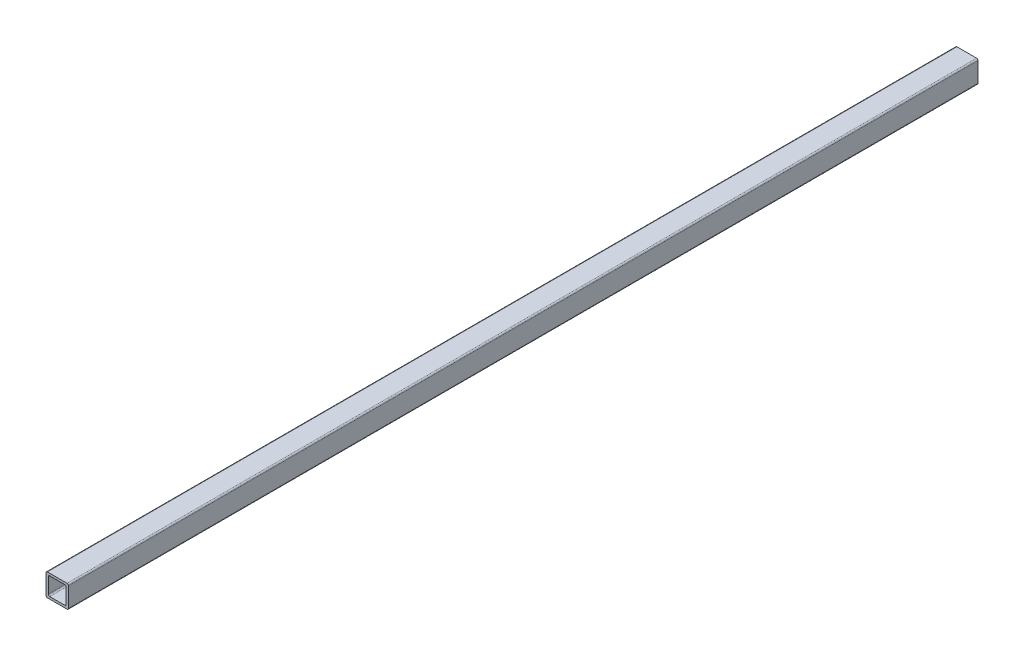
ISO-10303-21;
HEADER;
FILE_DESCRIPTION(('STEP AP214'),'2;1');
FILE_NAME('part.step','',(''),(''),'','','');
FILE_SCHEMA(('AUTOMOTIVE_DESIGN { 1 0 10303 214 1 1 1 1 }'));
ENDSEC;
DATA;
#1=APPLICATION_CONTEXT('core data for automotive mechanical design processes');
#2=APPLICATION_PROTOCOL_DEFINITION('international standard','automotive_design',2000,#1);
#3=PRODUCT_CONTEXT('',#1,'mechanical');
#4=PRODUCT('Part','Part','',(#3));
#5=PRODUCT_RELATED_PRODUCT_CATEGORY('part','',(#4));
#6=PRODUCT_DEFINITION_FORMATION('','',#4);
#7=PRODUCT_DEFINITION_CONTEXT('part definition',#1,'design');
#8=PRODUCT_DEFINITION('design','',#6,#7);
#9=PRODUCT_DEFINITION_SHAPE('','',#8);
#10=(LENGTH_UNIT() NAMED_UNIT(*) SI_UNIT(.MILLI.,.METRE.));
#11=(NAMED_UNIT(*) PLANE_ANGLE_UNIT() SI_UNIT($,.RADIAN.));
#12=(NAMED_UNIT(*) SI_UNIT($,.STERADIAN.) SOLID_ANGLE_UNIT());
#13=UNCERTAINTY_MEASURE_WITH_UNIT(LENGTH_MEASURE(1.E-05),#10,'distance_accuracy_value','');
#14=(GEOMETRIC_REPRESENTATION_CONTEXT(3) GLOBAL_UNCERTAINTY_ASSIGNED_CONTEXT((#13)) GLOBAL_UNIT_ASSIGNED_CONTEXT((#10,
#11,#12)) REPRESENTATION_CONTEXT('',''));
#15=CARTESIAN_POINT('',(0.,0.,0.));
#16=DIRECTION('',(0.,0.,1.));
#17=DIRECTION('',(1.,0.,0.));
#18=AXIS2_PLACEMENT_3D('',#15,#16,#17);
#19=CARTESIAN_POINT('',(0.,0.,320.));
#20=DIRECTION('',(0.,0.,1.));
#21=DIRECTION('',(1.,0.,0.));
#22=AXIS2_PLACEMENT_3D('',#19,#20,#21);
#23=PLANE('',#22);
#24=DIRECTION('',(0.,1.,0.));
#25=VECTOR('',#24,1.);
#26=CARTESIAN_POINT('',(3.95,-3.95,320.));
#27=LINE('',#26,#25);
#28=CARTESIAN_POINT('',(3.95,-3.45,320.));
#29=VERTEX_POINT('',#28);
#30=CARTESIAN_POINT('',(3.95,3.45,320.));
#31=VERTEX_POINT('',#30);
#32=EDGE_CURVE('E329',#29,#31,#27,.T.);
#33=ORIENTED_EDGE('',*,*,#32,.T.);
#34=CARTESIAN_POINT('',(3.45,3.45,320.));
#35=DIRECTION('',(0.,0.,1.));
#36=DIRECTION('',(1.,0.,0.));
#37=AXIS2_PLACEMENT_3D('',#34,#35,#36);
#38=CIRCLE('',#37,0.5);
#39=CARTESIAN_POINT('',(3.45,3.95,320.));
#40=VERTEX_POINT('',#39);
#41=EDGE_CURVE('E219',#31,#40,#38,.T.);
#42=ORIENTED_EDGE('',*,*,#41,.T.);
#43=DIRECTION('',(-1.,0.,0.));
#44=VECTOR('',#43,1.);
#45=CARTESIAN_POINT('',(3.95,3.95,320.));
#46=LINE('',#45,#44);
#47=CARTESIAN_POINT('',(-3.45,3.95,320.));
#48=VERTEX_POINT('',#47);
#49=EDGE_CURVE('E175',#40,#48,#46,.T.);
#50=ORIENTED_EDGE('',*,*,#49,.T.);
#51=CARTESIAN_POINT('',(-3.45,3.45,320.));
#52=DIRECTION('',(0.,0.,1.));
#53=DIRECTION('',(1.,0.,0.));
#54=AXIS2_PLACEMENT_3D('',#51,#52,#53);
#55=CIRCLE('',#54,0.5);
#56=CARTESIAN_POINT('',(-3.95,3.45,320.));
#57=VERTEX_POINT('',#56);
#58=EDGE_CURVE('E210',#48,#57,#55,.T.);
#59=ORIENTED_EDGE('',*,*,#58,.T.);
#60=DIRECTION('',(0.,-1.,0.));
#61=VECTOR('',#60,1.);
#62=CARTESIAN_POINT('',(-3.95,-3.95,320.));
#63=LINE('',#62,#61);
#64=CARTESIAN_POINT('',(-3.95,-3.45,320.));
#65=VERTEX_POINT('',#64);
#66=EDGE_CURVE('E184',#57,#65,#63,.T.);
#67=ORIENTED_EDGE('',*,*,#66,.T.);
#68=CARTESIAN_POINT('',(-3.45,-3.45,320.));
#69=DIRECTION('',(0.,0.,1.));
#70=DIRECTION('',(1.,0.,0.));
#71=AXIS2_PLACEMENT_3D('',#68,#69,#70);
#72=CIRCLE('',#71,0.5);
#73=CARTESIAN_POINT('',(-3.45,-3.95,320.));
#74=VERTEX_POINT('',#73);
#75=EDGE_CURVE('E213',#65,#74,#72,.T.);
#76=ORIENTED_EDGE('',*,*,#75,.T.);
#77=DIRECTION('',(1.,0.,0.));
#78=VECTOR('',#77,1.);
#79=CARTESIAN_POINT('',(3.95,-3.95,320.));
#80=LINE('',#79,#78);
#81=CARTESIAN_POINT('',(3.45,-3.95,320.));
#82=VERTEX_POINT('',#81);
#83=EDGE_CURVE('E190',#74,#82,#80,.T.);
#84=ORIENTED_EDGE('',*,*,#83,.T.);
#85=CARTESIAN_POINT('',(3.45,-3.45,320.));
#86=DIRECTION('',(0.,0.,1.));
#87=DIRECTION('',(1.,0.,0.));
#88=AXIS2_PLACEMENT_3D('',#85,#86,#87);
#89=CIRCLE('',#88,0.5);
#90=EDGE_CURVE('E216',#82,#29,#89,.T.);
#91=ORIENTED_EDGE('',*,*,#90,.T.);
#92=EDGE_LOOP('',(#33,#42,#50,#59,#67,#76,#84,#91));
#93=FACE_BOUND('',#92,.T.);
#94=DIRECTION('',(1.,0.,0.));
#95=VECTOR('',#94,1.);
#96=CARTESIAN_POINT('',(3.15,-3.15,320.));
#97=LINE('',#96,#95);
#98=CARTESIAN_POINT('',(-2.65,-3.15,320.));
#99=VERTEX_POINT('',#98);
#100=CARTESIAN_POINT('',(2.65,-3.15,320.));
#101=VERTEX_POINT('',#100);
#102=EDGE_CURVE('E313',#99,#101,#97,.T.);
#103=ORIENTED_EDGE('',*,*,#102,.F.);
#104=CARTESIAN_POINT('',(-2.65,-2.65,320.));
#105=DIRECTION('',(0.,0.,1.));
#106=DIRECTION('',(1.,0.,0.));
#107=AXIS2_PLACEMENT_3D('',#104,#105,#106);
#108=CIRCLE('',#107,0.5);
#109=CARTESIAN_POINT('',(-3.15,-2.65,320.));
#110=VERTEX_POINT('',#109);
#111=EDGE_CURVE('E277',#99,#110,#108,.F.);
#112=ORIENTED_EDGE('',*,*,#111,.T.);
#113=DIRECTION('',(0.,-1.,0.));
#114=VECTOR('',#113,1.);
#115=CARTESIAN_POINT('',(-3.15,-3.15,320.));
#116=LINE('',#115,#114);
#117=CARTESIAN_POINT('',(-3.15,2.65,320.));
#118=VERTEX_POINT('',#117);
#119=EDGE_CURVE('E301',#118,#110,#116,.T.);
#120=ORIENTED_EDGE('',*,*,#119,.F.);
#121=CARTESIAN_POINT('',(-2.65,2.65,320.));
#122=DIRECTION('',(0.,0.,1.));
#123=DIRECTION('',(1.,0.,0.));
#124=AXIS2_PLACEMENT_3D('',#121,#122,#123);
#125=CIRCLE('',#124,0.5);
#126=CARTESIAN_POINT('',(-2.65,3.15,320.));
#127=VERTEX_POINT('',#126);
#128=EDGE_CURVE('E11',#118,#127,#125,.F.);
#129=ORIENTED_EDGE('',*,*,#128,.T.);
#130=DIRECTION('',(-1.,0.,0.));
#131=VECTOR('',#130,1.);
#132=CARTESIAN_POINT('',(3.15,3.15,320.));
#133=LINE('',#132,#131);
#134=CARTESIAN_POINT('',(2.65,3.15,320.));
#135=VERTEX_POINT('',#134);
#136=EDGE_CURVE('E300',#135,#127,#133,.T.);
#137=ORIENTED_EDGE('',*,*,#136,.F.);
#138=CARTESIAN_POINT('',(2.65,2.65,320.));
#139=DIRECTION('',(0.,0.,1.));
#140=DIRECTION('',(1.,0.,0.));
#141=AXIS2_PLACEMENT_3D('',#138,#139,#140);
#142=CIRCLE('',#141,0.5);
#143=CARTESIAN_POINT('',(3.15,2.65,320.));
#144=VERTEX_POINT('',#143);
#145=EDGE_CURVE('E55',#135,#144,#142,.F.);
#146=ORIENTED_EDGE('',*,*,#145,.T.);
#147=DIRECTION('',(0.,1.,0.));
#148=VECTOR('',#147,1.);
#149=CARTESIAN_POINT('',(3.15,-3.15,320.));
#150=LINE('',#149,#148);
#151=CARTESIAN_POINT('',(3.15,-2.65,320.));
#152=VERTEX_POINT('',#151);
#153=EDGE_CURVE('E307',#152,#144,#150,.T.);
#154=ORIENTED_EDGE('',*,*,#153,.F.);
#155=CARTESIAN_POINT('',(2.65,-2.65,320.));
#156=DIRECTION('',(0.,0.,1.));
#157=DIRECTION('',(1.,0.,0.));
#158=AXIS2_PLACEMENT_3D('',#155,#156,#157);
#159=CIRCLE('',#158,0.5);
#160=EDGE_CURVE('E271',#152,#101,#159,.F.);
#161=ORIENTED_EDGE('',*,*,#160,.T.);
#162=EDGE_LOOP('',(#103,#112,#120,#129,#137,#146,#154,#161));
#163=FACE_BOUND('',#162,.T.);
#164=ADVANCED_FACE('F39',(#93,#163),#23,.T.);
#165=CARTESIAN_POINT('',(0.,0.,0.));
#166=DIRECTION('',(0.,0.,1.));
#167=DIRECTION('',(1.,0.,0.));
#168=AXIS2_PLACEMENT_3D('',#165,#166,#167);
#169=PLANE('',#168);
#170=DIRECTION('',(-1.,0.,0.));
#171=VECTOR('',#170,1.);
#172=CARTESIAN_POINT('',(3.95,3.95,0.));
#173=LINE('',#172,#171);
#174=CARTESIAN_POINT('',(3.45,3.95,0.));
#175=VERTEX_POINT('',#174);
#176=CARTESIAN_POINT('',(-3.45,3.95,0.));
#177=VERTEX_POINT('',#176);
#178=EDGE_CURVE('E172',#175,#177,#173,.T.);
#179=ORIENTED_EDGE('',*,*,#178,.F.);
#180=CARTESIAN_POINT('',(3.45,3.45,0.));
#181=DIRECTION('',(0.,0.,1.));
#182=DIRECTION('',(1.,0.,0.));
#183=AXIS2_PLACEMENT_3D('',#180,#181,#182);
#184=CIRCLE('',#183,0.5);
#185=CARTESIAN_POINT('',(3.95,3.45,0.));
#186=VERTEX_POINT('',#185);
#187=EDGE_CURVE('E154',#175,#186,#184,.F.);
#188=ORIENTED_EDGE('',*,*,#187,.T.);
#189=DIRECTION('',(0.,1.,0.));
#190=VECTOR('',#189,1.);
#191=CARTESIAN_POINT('',(3.95,-3.95,0.));
#192=LINE('',#191,#190);
#193=CARTESIAN_POINT('',(3.95,-3.45,0.));
#194=VERTEX_POINT('',#193);
#195=EDGE_CURVE('E185',#194,#186,#192,.T.);
#196=ORIENTED_EDGE('',*,*,#195,.F.);
#197=CARTESIAN_POINT('',(3.45,-3.45,0.));
#198=DIRECTION('',(0.,0.,1.));
#199=DIRECTION('',(1.,0.,0.));
#200=AXIS2_PLACEMENT_3D('',#197,#198,#199);
#201=CIRCLE('',#200,0.5);
#202=CARTESIAN_POINT('',(3.45,-3.95,0.));
#203=VERTEX_POINT('',#202);
#204=EDGE_CURVE('E166',#194,#203,#201,.F.);
#205=ORIENTED_EDGE('',*,*,#204,.T.);
#206=DIRECTION('',(1.,0.,0.));
#207=VECTOR('',#206,1.);
#208=CARTESIAN_POINT('',(3.95,-3.95,0.));
#209=LINE('',#208,#207);
#210=CARTESIAN_POINT('',(-3.45,-3.95,0.));
#211=VERTEX_POINT('',#210);
#212=EDGE_CURVE('E192',#211,#203,#209,.T.);
#213=ORIENTED_EDGE('',*,*,#212,.F.);
#214=CARTESIAN_POINT('',(-3.45,-3.45,0.));
#215=DIRECTION('',(0.,0.,1.));
#216=DIRECTION('',(1.,0.,0.));
#217=AXIS2_PLACEMENT_3D('',#214,#215,#216);
#218=CIRCLE('',#217,0.5);
#219=CARTESIAN_POINT('',(-3.95,-3.45,0.));
#220=VERTEX_POINT('',#219);
#221=EDGE_CURVE('E200',#211,#220,#218,.F.);
#222=ORIENTED_EDGE('',*,*,#221,.T.);
#223=DIRECTION('',(0.,-1.,0.));
#224=VECTOR('',#223,1.);
#225=CARTESIAN_POINT('',(-3.95,-3.95,0.));
#226=LINE('',#225,#224);
#227=CARTESIAN_POINT('',(-3.95,3.45,0.));
#228=VERTEX_POINT('',#227);
#229=EDGE_CURVE('E306',#228,#220,#226,.T.);
#230=ORIENTED_EDGE('',*,*,#229,.F.);
#231=CARTESIAN_POINT('',(-3.45,3.45,0.));
#232=DIRECTION('',(0.,0.,1.));
#233=DIRECTION('',(1.,0.,0.));
#234=AXIS2_PLACEMENT_3D('',#231,#232,#233);
#235=CIRCLE('',#234,0.5);
#236=EDGE_CURVE('E177',#228,#177,#235,.F.);
#237=ORIENTED_EDGE('',*,*,#236,.T.);
#238=EDGE_LOOP('',(#179,#188,#196,#205,#213,#222,#230,#237));
#239=FACE_BOUND('',#238,.T.);
#240=DIRECTION('',(-1.,0.,0.));
#241=VECTOR('',#240,1.);
#242=CARTESIAN_POINT('',(3.15,3.15,0.));
#243=LINE('',#242,#241);
#244=CARTESIAN_POINT('',(2.65,3.15,0.));
#245=VERTEX_POINT('',#244);
#246=CARTESIAN_POINT('',(-2.65,3.15,0.));
#247=VERTEX_POINT('',#246);
#248=EDGE_CURVE('E285',#245,#247,#243,.T.);
#249=ORIENTED_EDGE('',*,*,#248,.T.);
#250=CARTESIAN_POINT('',(-2.65,2.65,0.));
#251=DIRECTION('',(0.,0.,1.));
#252=DIRECTION('',(1.,0.,0.));
#253=AXIS2_PLACEMENT_3D('',#250,#251,#252);
#254=CIRCLE('',#253,0.5);
#255=CARTESIAN_POINT('',(-3.15,2.65,0.));
#256=VERTEX_POINT('',#255);
#257=EDGE_CURVE('E48',#247,#256,#254,.T.);
#258=ORIENTED_EDGE('',*,*,#257,.T.);
#259=DIRECTION('',(0.,-1.,0.));
#260=VECTOR('',#259,1.);
#261=CARTESIAN_POINT('',(-3.15,-3.15,0.));
#262=LINE('',#261,#260);
#263=CARTESIAN_POINT('',(-3.15,-2.65,0.));
#264=VERTEX_POINT('',#263);
#265=EDGE_CURVE('E283',#256,#264,#262,.T.);
#266=ORIENTED_EDGE('',*,*,#265,.T.);
#267=CARTESIAN_POINT('',(-2.65,-2.65,0.));
#268=DIRECTION('',(0.,0.,1.));
#269=DIRECTION('',(1.,0.,0.));
#270=AXIS2_PLACEMENT_3D('',#267,#268,#269);
#271=CIRCLE('',#270,0.5);
#272=CARTESIAN_POINT('',(-2.65,-3.15,0.));
#273=VERTEX_POINT('',#272);
#274=EDGE_CURVE('E274',#264,#273,#271,.T.);
#275=ORIENTED_EDGE('',*,*,#274,.T.);
#276=DIRECTION('',(1.,0.,0.));
#277=VECTOR('',#276,1.);
#278=CARTESIAN_POINT('',(3.15,-3.15,0.));
#279=LINE('',#278,#277);
#280=CARTESIAN_POINT('',(2.65,-3.15,0.));
#281=VERTEX_POINT('',#280);
#282=EDGE_CURVE('E295',#273,#281,#279,.T.);
#283=ORIENTED_EDGE('',*,*,#282,.T.);
#284=CARTESIAN_POINT('',(2.65,-2.65,0.));
#285=DIRECTION('',(0.,0.,1.));
#286=DIRECTION('',(1.,0.,0.));
#287=AXIS2_PLACEMENT_3D('',#284,#285,#286);
#288=CIRCLE('',#287,0.5);
#289=CARTESIAN_POINT('',(3.15,-2.65,0.));
#290=VERTEX_POINT('',#289);
#291=EDGE_CURVE('E268',#281,#290,#288,.T.);
#292=ORIENTED_EDGE('',*,*,#291,.T.);
#293=DIRECTION('',(0.,1.,0.));
#294=VECTOR('',#293,1.);
#295=CARTESIAN_POINT('',(3.15,-3.15,0.));
#296=LINE('',#295,#294);
#297=CARTESIAN_POINT('',(3.15,2.65,0.));
#298=VERTEX_POINT('',#297);
#299=EDGE_CURVE('E320',#290,#298,#296,.T.);
#300=ORIENTED_EDGE('',*,*,#299,.T.);
#301=CARTESIAN_POINT('',(2.65,2.65,0.));
#302=DIRECTION('',(0.,0.,1.));
#303=DIRECTION('',(1.,0.,0.));
#304=AXIS2_PLACEMENT_3D('',#301,#302,#303);
#305=CIRCLE('',#304,0.5);
#306=EDGE_CURVE('E263',#298,#245,#305,.T.);
#307=ORIENTED_EDGE('',*,*,#306,.T.);
#308=EDGE_LOOP('',(#249,#258,#266,#275,#283,#292,#300,#307));
#309=FACE_BOUND('',#308,.T.);
#310=ADVANCED_FACE('F180',(#239,#309),#169,.F.);
#311=CARTESIAN_POINT('',(-3.95,-3.95,320.));
#312=DIRECTION('',(1.,0.,0.));
#313=DIRECTION('',(0.,0.,-1.));
#314=AXIS2_PLACEMENT_3D('',#311,#312,#313);
#315=PLANE('',#314);
#316=ORIENTED_EDGE('',*,*,#229,.T.);
#317=DIRECTION('',(0.,0.,-1.));
#318=VECTOR('',#317,1.);
#319=CARTESIAN_POINT('',(-3.95,-3.45,320.));
#320=LINE('',#319,#318);
#321=EDGE_CURVE('E260',#220,#65,#320,.F.);
#322=ORIENTED_EDGE('',*,*,#321,.T.);
#323=ORIENTED_EDGE('',*,*,#66,.F.);
#324=DIRECTION('',(0.,0.,-1.));
#325=VECTOR('',#324,1.);
#326=CARTESIAN_POINT('',(-3.95,3.45,320.));
#327=LINE('',#326,#325);
#328=EDGE_CURVE('E256',#57,#228,#327,.T.);
#329=ORIENTED_EDGE('',*,*,#328,.T.);
#330=EDGE_LOOP('',(#316,#322,#323,#329));
#331=FACE_BOUND('',#330,.T.);
#332=ADVANCED_FACE('F357',(#331),#315,.F.);
#333=CARTESIAN_POINT('',(3.95,-3.95,320.));
#334=DIRECTION('',(0.,1.,0.));
#335=DIRECTION('',(0.,0.,1.));
#336=AXIS2_PLACEMENT_3D('',#333,#334,#335);
#337=PLANE('',#336);
#338=ORIENTED_EDGE('',*,*,#212,.T.);
#339=DIRECTION('',(0.,0.,-1.));
#340=VECTOR('',#339,1.);
#341=CARTESIAN_POINT('',(3.45,-3.95,320.));
#342=LINE('',#341,#340);
#343=EDGE_CURVE('E239',#203,#82,#342,.F.);
#344=ORIENTED_EDGE('',*,*,#343,.T.);
#345=ORIENTED_EDGE('',*,*,#83,.F.);
#346=DIRECTION('',(0.,0.,-1.));
#347=VECTOR('',#346,1.);
#348=CARTESIAN_POINT('',(-3.45,-3.95,320.));
#349=LINE('',#348,#347);
#350=EDGE_CURVE('E235',#74,#211,#349,.T.);
#351=ORIENTED_EDGE('',*,*,#350,.T.);
#352=EDGE_LOOP('',(#338,#344,#345,#351));
#353=FACE_BOUND('',#352,.T.);
#354=ADVANCED_FACE('F339',(#353),#337,.F.);
#355=CARTESIAN_POINT('',(3.95,-3.95,320.));
#356=DIRECTION('',(-1.,0.,0.));
#357=DIRECTION('',(0.,0.,1.));
#358=AXIS2_PLACEMENT_3D('',#355,#356,#357);
#359=PLANE('',#358);
#360=ORIENTED_EDGE('',*,*,#195,.T.);
#361=DIRECTION('',(0.,0.,-1.));
#362=VECTOR('',#361,1.);
#363=CARTESIAN_POINT('',(3.95,3.45,320.));
#364=LINE('',#363,#362);
#365=EDGE_CURVE('E159',#186,#31,#364,.F.);
#366=ORIENTED_EDGE('',*,*,#365,.T.);
#367=ORIENTED_EDGE('',*,*,#32,.F.);
#368=DIRECTION('',(0.,0.,-1.));
#369=VECTOR('',#368,1.);
#370=CARTESIAN_POINT('',(3.95,-3.45,320.));
#371=LINE('',#370,#369);
#372=EDGE_CURVE('E165',#29,#194,#371,.T.);
#373=ORIENTED_EDGE('',*,*,#372,.T.);
#374=EDGE_LOOP('',(#360,#366,#367,#373));
#375=FACE_BOUND('',#374,.T.);
#376=ADVANCED_FACE('F349',(#375),#359,.F.);
#377=CARTESIAN_POINT('',(3.95,3.95,320.));
#378=DIRECTION('',(0.,-1.,0.));
#379=DIRECTION('',(0.,0.,-1.));
#380=AXIS2_PLACEMENT_3D('',#377,#378,#379);
#381=PLANE('',#380);
#382=ORIENTED_EDGE('',*,*,#49,.F.);
#383=DIRECTION('',(0.,0.,-1.));
#384=VECTOR('',#383,1.);
#385=CARTESIAN_POINT('',(3.45,3.95,320.));
#386=LINE('',#385,#384);
#387=EDGE_CURVE('E158',#40,#175,#386,.T.);
#388=ORIENTED_EDGE('',*,*,#387,.T.);
#389=ORIENTED_EDGE('',*,*,#178,.T.);
#390=DIRECTION('',(0.,0.,-1.));
#391=VECTOR('',#390,1.);
#392=CARTESIAN_POINT('',(-3.45,3.95,320.));
#393=LINE('',#392,#391);
#394=EDGE_CURVE('E178',#177,#48,#393,.F.);
#395=ORIENTED_EDGE('',*,*,#394,.T.);
#396=EDGE_LOOP('',(#382,#388,#389,#395));
#397=FACE_BOUND('',#396,.T.);
#398=ADVANCED_FACE('F171',(#397),#381,.F.);
#399=CARTESIAN_POINT('',(-3.15,-3.15,320.));
#400=DIRECTION('',(1.,0.,0.));
#401=DIRECTION('',(0.,0.,-1.));
#402=AXIS2_PLACEMENT_3D('',#399,#400,#401);
#403=PLANE('',#402);
#404=ORIENTED_EDGE('',*,*,#119,.T.);
#405=DIRECTION('',(0.,0.,-1.));
#406=VECTOR('',#405,1.);
#407=CARTESIAN_POINT('',(-3.15,-2.65,0.));
#408=LINE('',#407,#406);
#409=EDGE_CURVE('E252',#110,#264,#408,.T.);
#410=ORIENTED_EDGE('',*,*,#409,.T.);
#411=ORIENTED_EDGE('',*,*,#265,.F.);
#412=DIRECTION('',(0.,0.,-1.));
#413=VECTOR('',#412,1.);
#414=CARTESIAN_POINT('',(-3.15,2.65,320.));
#415=LINE('',#414,#413);
#416=EDGE_CURVE('E249',#256,#118,#415,.F.);
#417=ORIENTED_EDGE('',*,*,#416,.T.);
#418=EDGE_LOOP('',(#404,#410,#411,#417));
#419=FACE_BOUND('',#418,.T.);
#420=ADVANCED_FACE('F291',(#419),#403,.T.);
#421=CARTESIAN_POINT('',(3.15,-3.15,320.));
#422=DIRECTION('',(0.,1.,0.));
#423=DIRECTION('',(0.,0.,1.));
#424=AXIS2_PLACEMENT_3D('',#421,#422,#423);
#425=PLANE('',#424);
#426=ORIENTED_EDGE('',*,*,#102,.T.);
#427=DIRECTION('',(0.,0.,-1.));
#428=VECTOR('',#427,1.);
#429=CARTESIAN_POINT('',(2.65,-3.15,0.));
#430=LINE('',#429,#428);
#431=EDGE_CURVE('E245',#101,#281,#430,.T.);
#432=ORIENTED_EDGE('',*,*,#431,.T.);
#433=ORIENTED_EDGE('',*,*,#282,.F.);
#434=DIRECTION('',(0.,0.,-1.));
#435=VECTOR('',#434,1.);
#436=CARTESIAN_POINT('',(-2.65,-3.15,320.));
#437=LINE('',#436,#435);
#438=EDGE_CURVE('E242',#273,#99,#437,.F.);
#439=ORIENTED_EDGE('',*,*,#438,.T.);
#440=EDGE_LOOP('',(#426,#432,#433,#439));
#441=FACE_BOUND('',#440,.T.);
#442=ADVANCED_FACE('F368',(#441),#425,.T.);
#443=CARTESIAN_POINT('',(3.15,-3.15,320.));
#444=DIRECTION('',(-1.,0.,0.));
#445=DIRECTION('',(0.,0.,1.));
#446=AXIS2_PLACEMENT_3D('',#443,#444,#445);
#447=PLANE('',#446);
#448=ORIENTED_EDGE('',*,*,#153,.T.);
#449=DIRECTION('',(0.,0.,-1.));
#450=VECTOR('',#449,1.);
#451=CARTESIAN_POINT('',(3.15,2.65,0.));
#452=LINE('',#451,#450);
#453=EDGE_CURVE('E224',#144,#298,#452,.T.);
#454=ORIENTED_EDGE('',*,*,#453,.T.);
#455=ORIENTED_EDGE('',*,*,#299,.F.);
#456=DIRECTION('',(0.,0.,-1.));
#457=VECTOR('',#456,1.);
#458=CARTESIAN_POINT('',(3.15,-2.65,320.));
#459=LINE('',#458,#457);
#460=EDGE_CURVE('E62',#290,#152,#459,.F.);
#461=ORIENTED_EDGE('',*,*,#460,.T.);
#462=EDGE_LOOP('',(#448,#454,#455,#461));
#463=FACE_BOUND('',#462,.T.);
#464=ADVANCED_FACE('F371',(#463),#447,.T.);
#465=CARTESIAN_POINT('',(3.15,3.15,320.));
#466=DIRECTION('',(0.,-1.,0.));
#467=DIRECTION('',(0.,0.,-1.));
#468=AXIS2_PLACEMENT_3D('',#465,#466,#467);
#469=PLANE('',#468);
#470=ORIENTED_EDGE('',*,*,#248,.F.);
#471=DIRECTION('',(0.,0.,-1.));
#472=VECTOR('',#471,1.);
#473=CARTESIAN_POINT('',(2.65,3.15,320.));
#474=LINE('',#473,#472);
#475=EDGE_CURVE('E232',#245,#135,#474,.F.);
#476=ORIENTED_EDGE('',*,*,#475,.T.);
#477=ORIENTED_EDGE('',*,*,#136,.T.);
#478=DIRECTION('',(0.,0.,-1.));
#479=VECTOR('',#478,1.);
#480=CARTESIAN_POINT('',(-2.65,3.15,0.));
#481=LINE('',#480,#479);
#482=EDGE_CURVE('E228',#127,#247,#481,.T.);
#483=ORIENTED_EDGE('',*,*,#482,.T.);
#484=EDGE_LOOP('',(#470,#476,#477,#483));
#485=FACE_BOUND('',#484,.T.);
#486=ADVANCED_FACE('F303',(#485),#469,.T.);
#487=CARTESIAN_POINT('',(3.45,3.45,320.));
#488=DIRECTION('',(0.,0.,-1.));
#489=DIRECTION('',(-1.,0.,0.));
#490=AXIS2_PLACEMENT_3D('',#487,#488,#489);
#491=CYLINDRICAL_SURFACE('',#490,0.5);
#492=ORIENTED_EDGE('',*,*,#41,.F.);
#493=ORIENTED_EDGE('',*,*,#365,.F.);
#494=ORIENTED_EDGE('',*,*,#187,.F.);
#495=ORIENTED_EDGE('',*,*,#387,.F.);
#496=EDGE_LOOP('',(#492,#493,#494,#495));
#497=FACE_BOUND('',#496,.T.);
#498=ADVANCED_FACE('F157',(#497),#491,.T.);
#499=CARTESIAN_POINT('',(2.65,2.65,320.));
#500=DIRECTION('',(0.,0.,1.));
#501=DIRECTION('',(1.,0.,0.));
#502=AXIS2_PLACEMENT_3D('',#499,#500,#501);
#503=CYLINDRICAL_SURFACE('',#502,0.5);
#504=ORIENTED_EDGE('',*,*,#145,.F.);
#505=ORIENTED_EDGE('',*,*,#475,.F.);
#506=ORIENTED_EDGE('',*,*,#306,.F.);
#507=ORIENTED_EDGE('',*,*,#453,.F.);
#508=EDGE_LOOP('',(#504,#505,#506,#507));
#509=FACE_BOUND('',#508,.T.);
#510=ADVANCED_FACE('F379',(#509),#503,.F.);
#511=CARTESIAN_POINT('',(3.45,-3.45,320.));
#512=DIRECTION('',(0.,0.,-1.));
#513=DIRECTION('',(-1.,0.,0.));
#514=AXIS2_PLACEMENT_3D('',#511,#512,#513);
#515=CYLINDRICAL_SURFACE('',#514,0.5);
#516=ORIENTED_EDGE('',*,*,#90,.F.);
#517=ORIENTED_EDGE('',*,*,#343,.F.);
#518=ORIENTED_EDGE('',*,*,#204,.F.);
#519=ORIENTED_EDGE('',*,*,#372,.F.);
#520=EDGE_LOOP('',(#516,#517,#518,#519));
#521=FACE_BOUND('',#520,.T.);
#522=ADVANCED_FACE('F344',(#521),#515,.T.);
#523=CARTESIAN_POINT('',(2.65,-2.65,320.));
#524=DIRECTION('',(0.,0.,1.));
#525=DIRECTION('',(1.,0.,0.));
#526=AXIS2_PLACEMENT_3D('',#523,#524,#525);
#527=CYLINDRICAL_SURFACE('',#526,0.5);
#528=ORIENTED_EDGE('',*,*,#160,.F.);
#529=ORIENTED_EDGE('',*,*,#460,.F.);
#530=ORIENTED_EDGE('',*,*,#291,.F.);
#531=ORIENTED_EDGE('',*,*,#431,.F.);
#532=EDGE_LOOP('',(#528,#529,#530,#531));
#533=FACE_BOUND('',#532,.T.);
#534=ADVANCED_FACE('F390',(#533),#527,.F.);
#535=CARTESIAN_POINT('',(-2.65,-2.65,320.));
#536=DIRECTION('',(0.,0.,1.));
#537=DIRECTION('',(1.,0.,0.));
#538=AXIS2_PLACEMENT_3D('',#535,#536,#537);
#539=CYLINDRICAL_SURFACE('',#538,0.5);
#540=ORIENTED_EDGE('',*,*,#111,.F.);
#541=ORIENTED_EDGE('',*,*,#438,.F.);
#542=ORIENTED_EDGE('',*,*,#274,.F.);
#543=ORIENTED_EDGE('',*,*,#409,.F.);
#544=EDGE_LOOP('',(#540,#541,#542,#543));
#545=FACE_BOUND('',#544,.T.);
#546=ADVANCED_FACE('F393',(#545),#539,.F.);
#547=CARTESIAN_POINT('',(-3.45,-3.45,320.));
#548=DIRECTION('',(0.,0.,-1.));
#549=DIRECTION('',(-1.,0.,0.));
#550=AXIS2_PLACEMENT_3D('',#547,#548,#549);
#551=CYLINDRICAL_SURFACE('',#550,0.5);
#552=ORIENTED_EDGE('',*,*,#75,.F.);
#553=ORIENTED_EDGE('',*,*,#321,.F.);
#554=ORIENTED_EDGE('',*,*,#221,.F.);
#555=ORIENTED_EDGE('',*,*,#350,.F.);
#556=EDGE_LOOP('',(#552,#553,#554,#555));
#557=FACE_BOUND('',#556,.T.);
#558=ADVANCED_FACE('F397',(#557),#551,.T.);
#559=CARTESIAN_POINT('',(-3.45,3.45,320.));
#560=DIRECTION('',(0.,0.,-1.));
#561=DIRECTION('',(-1.,0.,0.));
#562=AXIS2_PLACEMENT_3D('',#559,#560,#561);
#563=CYLINDRICAL_SURFACE('',#562,0.5);
#564=ORIENTED_EDGE('',*,*,#58,.F.);
#565=ORIENTED_EDGE('',*,*,#394,.F.);
#566=ORIENTED_EDGE('',*,*,#236,.F.);
#567=ORIENTED_EDGE('',*,*,#328,.F.);
#568=EDGE_LOOP('',(#564,#565,#566,#567));
#569=FACE_BOUND('',#568,.T.);
#570=ADVANCED_FACE('F400',(#569),#563,.T.);
#571=CARTESIAN_POINT('',(-2.65,2.65,320.));
#572=DIRECTION('',(0.,0.,1.));
#573=DIRECTION('',(1.,0.,0.));
#574=AXIS2_PLACEMENT_3D('',#571,#572,#573);
#575=CYLINDRICAL_SURFACE('',#574,0.5);
#576=ORIENTED_EDGE('',*,*,#128,.F.);
#577=ORIENTED_EDGE('',*,*,#416,.F.);
#578=ORIENTED_EDGE('',*,*,#257,.F.);
#579=ORIENTED_EDGE('',*,*,#482,.F.);
#580=EDGE_LOOP('',(#576,#577,#578,#579));
#581=FACE_BOUND('',#580,.T.);
#582=ADVANCED_FACE('F41',(#581),#575,.F.);
#583=CLOSED_SHELL('',(#164,#310,#332,#354,#376,#398,#420,#442,#464,#486,#498,#510,#522,#534,
#546,#558,#570,#582));
#584=MANIFOLD_SOLID_BREP('B2',#583);
#585=ADVANCED_BREP_SHAPE_REPRESENTATION('',(#18,#584),#14);
#586=SHAPE_DEFINITION_REPRESENTATION(#9,#585);
ENDSEC;
END-ISO-10303-21;
